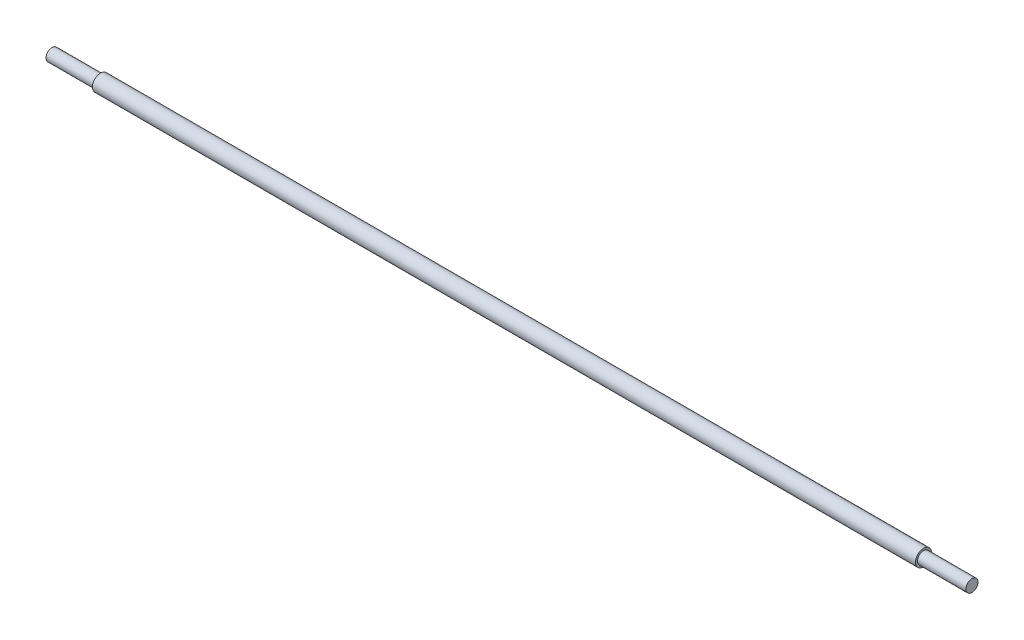
ISO-10303-21;
HEADER;
FILE_DESCRIPTION(('STEP AP214'),'2;1');
FILE_NAME('part.step','',(''),(''),'','','');
FILE_SCHEMA(('AUTOMOTIVE_DESIGN { 1 0 10303 214 1 1 1 1 }'));
ENDSEC;
DATA;
#1=APPLICATION_CONTEXT('core data for automotive mechanical design processes');
#2=APPLICATION_PROTOCOL_DEFINITION('international standard','automotive_design',2000,#1);
#3=PRODUCT_CONTEXT('',#1,'mechanical');
#4=PRODUCT('Part','Part','',(#3));
#5=PRODUCT_RELATED_PRODUCT_CATEGORY('part','',(#4));
#6=PRODUCT_DEFINITION_FORMATION('','',#4);
#7=PRODUCT_DEFINITION_CONTEXT('part definition',#1,'design');
#8=PRODUCT_DEFINITION('design','',#6,#7);
#9=PRODUCT_DEFINITION_SHAPE('','',#8);
#10=(LENGTH_UNIT() NAMED_UNIT(*) SI_UNIT(.MILLI.,.METRE.));
#11=(NAMED_UNIT(*) PLANE_ANGLE_UNIT() SI_UNIT($,.RADIAN.));
#12=(NAMED_UNIT(*) SI_UNIT($,.STERADIAN.) SOLID_ANGLE_UNIT());
#13=UNCERTAINTY_MEASURE_WITH_UNIT(LENGTH_MEASURE(1.E-05),#10,'distance_accuracy_value','');
#14=(GEOMETRIC_REPRESENTATION_CONTEXT(3) GLOBAL_UNCERTAINTY_ASSIGNED_CONTEXT((#13)) GLOBAL_UNIT_ASSIGNED_CONTEXT((#10,
#11,#12)) REPRESENTATION_CONTEXT('',''));
#15=CARTESIAN_POINT('',(0.,0.,0.));
#16=DIRECTION('',(0.,0.,1.));
#17=DIRECTION('',(1.,0.,0.));
#18=AXIS2_PLACEMENT_3D('',#15,#16,#17);
#19=CARTESIAN_POINT('',(-647.7,0.,-9.525));
#20=DIRECTION('',(1.,0.,0.));
#21=DIRECTION('',(0.,0.,-1.));
#22=AXIS2_PLACEMENT_3D('',#19,#20,#21);
#23=PLANE('',#22);
#24=CARTESIAN_POINT('',(-647.7,0.,0.));
#25=DIRECTION('',(-1.,0.,0.));
#26=DIRECTION('',(0.,0.,1.));
#27=AXIS2_PLACEMENT_3D('',#24,#25,#26);
#28=CIRCLE('',#27,9.52499999999999);
#29=CARTESIAN_POINT('',(-647.7,0.,9.52499999999998));
#30=VERTEX_POINT('',#29);
#31=EDGE_CURVE('E56',#30,#30,#28,.T.);
#32=ORIENTED_EDGE('',*,*,#31,.F.);
#33=EDGE_LOOP('',(#32));
#34=FACE_BOUND('',#33,.T.);
#35=CARTESIAN_POINT('',(-647.7,0.,0.));
#36=DIRECTION('',(-1.,0.,0.));
#37=DIRECTION('',(0.,0.,1.));
#38=AXIS2_PLACEMENT_3D('',#35,#36,#37);
#39=CIRCLE('',#38,12.7);
#40=CARTESIAN_POINT('',(-647.7,0.,12.7));
#41=VERTEX_POINT('',#40);
#42=EDGE_CURVE('E10',#41,#41,#39,.T.);
#43=ORIENTED_EDGE('',*,*,#42,.T.);
#44=EDGE_LOOP('',(#43));
#45=FACE_BOUND('',#44,.T.);
#46=ADVANCED_FACE('F34',(#34,#45),#23,.F.);
#47=CARTESIAN_POINT('',(-723.9,0.,0.));
#48=DIRECTION('',(-1.,0.,0.));
#49=DIRECTION('',(0.,0.,1.));
#50=AXIS2_PLACEMENT_3D('',#47,#48,#49);
#51=CYLINDRICAL_SURFACE('',#50,12.7);
#52=ORIENTED_EDGE('',*,*,#42,.F.);
#53=EDGE_LOOP('',(#52));
#54=FACE_BOUND('',#53,.T.);
#55=CARTESIAN_POINT('',(647.7,0.,-1.67972554971051E-13));
#56=DIRECTION('',(-1.,0.,0.));
#57=DIRECTION('',(0.,0.,1.));
#58=AXIS2_PLACEMENT_3D('',#55,#56,#57);
#59=CIRCLE('',#58,12.7);
#60=CARTESIAN_POINT('',(647.7,0.,12.6999999999998));
#61=VERTEX_POINT('',#60);
#62=EDGE_CURVE('E40',#61,#61,#59,.T.);
#63=ORIENTED_EDGE('',*,*,#62,.T.);
#64=EDGE_LOOP('',(#63));
#65=FACE_BOUND('',#64,.T.);
#66=ADVANCED_FACE('F63',(#54,#65),#51,.T.);
#67=CARTESIAN_POINT('',(647.7,0.,-9.52500000000016));
#68=DIRECTION('',(-1.,0.,0.));
#69=DIRECTION('',(0.,0.,1.));
#70=AXIS2_PLACEMENT_3D('',#67,#68,#69);
#71=PLANE('',#70);
#72=ORIENTED_EDGE('',*,*,#62,.F.);
#73=EDGE_LOOP('',(#72));
#74=FACE_BOUND('',#73,.T.);
#75=CARTESIAN_POINT('',(647.7,0.,-1.67972554971051E-13));
#76=DIRECTION('',(-1.,0.,0.));
#77=DIRECTION('',(0.,0.,1.));
#78=AXIS2_PLACEMENT_3D('',#75,#76,#77);
#79=CIRCLE('',#78,9.52499999999999);
#80=CARTESIAN_POINT('',(647.7,0.,9.52499999999982));
#81=VERTEX_POINT('',#80);
#82=EDGE_CURVE('E44',#81,#81,#79,.T.);
#83=ORIENTED_EDGE('',*,*,#82,.T.);
#84=EDGE_LOOP('',(#83));
#85=FACE_BOUND('',#84,.T.);
#86=ADVANCED_FACE('F67',(#74,#85),#71,.F.);
#87=CARTESIAN_POINT('',(-723.9,0.,0.));
#88=DIRECTION('',(-1.,0.,0.));
#89=DIRECTION('',(0.,0.,1.));
#90=AXIS2_PLACEMENT_3D('',#87,#88,#89);
#91=CYLINDRICAL_SURFACE('',#90,9.525);
#92=ORIENTED_EDGE('',*,*,#82,.F.);
#93=EDGE_LOOP('',(#92));
#94=FACE_BOUND('',#93,.T.);
#95=CARTESIAN_POINT('',(723.9,0.,-1.77304363580554E-13));
#96=DIRECTION('',(-1.,0.,0.));
#97=DIRECTION('',(0.,0.,1.));
#98=AXIS2_PLACEMENT_3D('',#95,#96,#97);
#99=CIRCLE('',#98,9.525);
#100=CARTESIAN_POINT('',(723.9,0.,9.52499999999982));
#101=VERTEX_POINT('',#100);
#102=EDGE_CURVE('E48',#101,#101,#99,.T.);
#103=ORIENTED_EDGE('',*,*,#102,.T.);
#104=EDGE_LOOP('',(#103));
#105=FACE_BOUND('',#104,.T.);
#106=ADVANCED_FACE('F72',(#94,#105),#91,.T.);
#107=CARTESIAN_POINT('',(723.9,0.,-1.77304363580554E-13));
#108=DIRECTION('',(-1.,0.,0.));
#109=DIRECTION('',(0.,0.,1.));
#110=AXIS2_PLACEMENT_3D('',#107,#108,#109);
#111=PLANE('',#110);
#112=ORIENTED_EDGE('',*,*,#102,.F.);
#113=EDGE_LOOP('',(#112));
#114=FACE_BOUND('',#113,.T.);
#115=ADVANCED_FACE('F78',(#114),#111,.F.);
#116=CARTESIAN_POINT('',(-723.9,0.,0.));
#117=DIRECTION('',(1.,0.,0.));
#118=DIRECTION('',(0.,0.,-1.));
#119=AXIS2_PLACEMENT_3D('',#116,#117,#118);
#120=PLANE('',#119);
#121=CARTESIAN_POINT('',(-723.9,0.,0.));
#122=DIRECTION('',(-1.,0.,0.));
#123=DIRECTION('',(0.,0.,1.));
#124=AXIS2_PLACEMENT_3D('',#121,#122,#123);
#125=CIRCLE('',#124,9.525);
#126=CARTESIAN_POINT('',(-723.9,0.,9.525));
#127=VERTEX_POINT('',#126);
#128=EDGE_CURVE('E53',#127,#127,#125,.T.);
#129=ORIENTED_EDGE('',*,*,#128,.T.);
#130=EDGE_LOOP('',(#129));
#131=FACE_BOUND('',#130,.T.);
#132=ADVANCED_FACE('F82',(#131),#120,.F.);
#133=CARTESIAN_POINT('',(-723.9,0.,0.));
#134=DIRECTION('',(-1.,0.,0.));
#135=DIRECTION('',(0.,0.,1.));
#136=AXIS2_PLACEMENT_3D('',#133,#134,#135);
#137=CYLINDRICAL_SURFACE('',#136,9.525);
#138=ORIENTED_EDGE('',*,*,#128,.F.);
#139=EDGE_LOOP('',(#138));
#140=FACE_BOUND('',#139,.T.);
#141=ORIENTED_EDGE('',*,*,#31,.T.);
#142=EDGE_LOOP('',(#141));
#143=FACE_BOUND('',#142,.T.);
#144=ADVANCED_FACE('F60',(#140,#143),#137,.T.);
#145=CLOSED_SHELL('',(#46,#66,#86,#106,#115,#132,#144));
#146=MANIFOLD_SOLID_BREP('B2',#145);
#147=ADVANCED_BREP_SHAPE_REPRESENTATION('',(#18,#146),#14);
#148=SHAPE_DEFINITION_REPRESENTATION(#9,#147);
ENDSEC;
END-ISO-10303-21;
